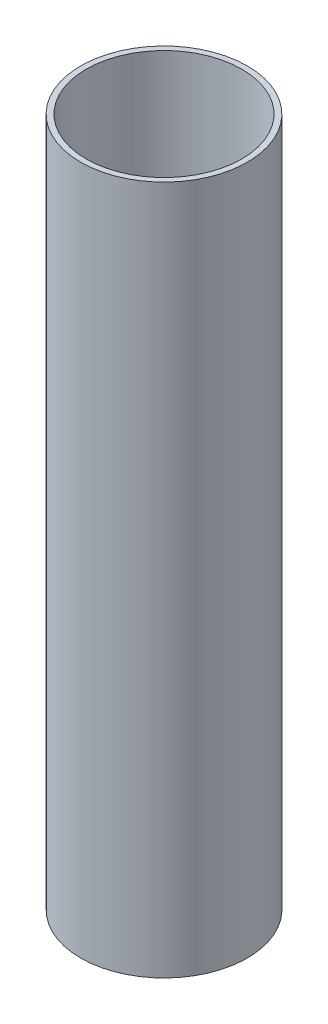
ISO-10303-21;
HEADER;
FILE_DESCRIPTION(('STEP AP214'),'2;1');
FILE_NAME('part.step','',(''),(''),'','','');
FILE_SCHEMA(('AUTOMOTIVE_DESIGN { 1 0 10303 214 1 1 1 1 }'));
ENDSEC;
DATA;
#1=APPLICATION_CONTEXT('core data for automotive mechanical design processes');
#2=APPLICATION_PROTOCOL_DEFINITION('international standard','automotive_design',2000,#1);
#3=PRODUCT_CONTEXT('',#1,'mechanical');
#4=PRODUCT('Part','Part','',(#3));
#5=PRODUCT_RELATED_PRODUCT_CATEGORY('part','',(#4));
#6=PRODUCT_DEFINITION_FORMATION('','',#4);
#7=PRODUCT_DEFINITION_CONTEXT('part definition',#1,'design');
#8=PRODUCT_DEFINITION('design','',#6,#7);
#9=PRODUCT_DEFINITION_SHAPE('','',#8);
#10=(LENGTH_UNIT() NAMED_UNIT(*) SI_UNIT(.MILLI.,.METRE.));
#11=(NAMED_UNIT(*) PLANE_ANGLE_UNIT() SI_UNIT($,.RADIAN.));
#12=(NAMED_UNIT(*) SI_UNIT($,.STERADIAN.) SOLID_ANGLE_UNIT());
#13=UNCERTAINTY_MEASURE_WITH_UNIT(LENGTH_MEASURE(1.E-05),#10,'distance_accuracy_value','');
#14=(GEOMETRIC_REPRESENTATION_CONTEXT(3) GLOBAL_UNCERTAINTY_ASSIGNED_CONTEXT((#13)) GLOBAL_UNIT_ASSIGNED_CONTEXT((#10,
#11,#12)) REPRESENTATION_CONTEXT('',''));
#15=CARTESIAN_POINT('',(0.,0.,0.));
#16=DIRECTION('',(0.,0.,1.));
#17=DIRECTION('',(1.,0.,0.));
#18=AXIS2_PLACEMENT_3D('',#15,#16,#17);
#19=CARTESIAN_POINT('',(0.,310.,0.));
#20=DIRECTION('',(0.,1.,0.));
#21=DIRECTION('',(0.,0.,1.));
#22=AXIS2_PLACEMENT_3D('',#19,#20,#21);
#23=PLANE('',#22);
#24=CARTESIAN_POINT('',(0.,310.,0.));
#25=DIRECTION('',(0.,1.,0.));
#26=DIRECTION('',(0.,0.,1.));
#27=AXIS2_PLACEMENT_3D('',#24,#25,#26);
#28=CIRCLE('',#27,37.5);
#29=CARTESIAN_POINT('',(0.,310.,37.5));
#30=VERTEX_POINT('',#29);
#31=EDGE_CURVE('E10',#30,#30,#28,.T.);
#32=ORIENTED_EDGE('',*,*,#31,.T.);
#33=EDGE_LOOP('',(#32));
#34=FACE_BOUND('',#33,.T.);
#35=CARTESIAN_POINT('',(0.,310.,0.));
#36=DIRECTION('',(0.,1.,0.));
#37=DIRECTION('',(0.,0.,1.));
#38=AXIS2_PLACEMENT_3D('',#35,#36,#37);
#39=CIRCLE('',#38,35.);
#40=CARTESIAN_POINT('',(0.,310.,35.));
#41=VERTEX_POINT('',#40);
#42=EDGE_CURVE('E49',#41,#41,#39,.T.);
#43=ORIENTED_EDGE('',*,*,#42,.F.);
#44=EDGE_LOOP('',(#43));
#45=FACE_BOUND('',#44,.T.);
#46=ADVANCED_FACE('F38',(#34,#45),#23,.T.);
#47=CARTESIAN_POINT('',(0.,0.,0.));
#48=DIRECTION('',(0.,1.,0.));
#49=DIRECTION('',(0.,0.,1.));
#50=AXIS2_PLACEMENT_3D('',#47,#48,#49);
#51=PLANE('',#50);
#52=CARTESIAN_POINT('',(0.,0.,0.));
#53=DIRECTION('',(0.,1.,0.));
#54=DIRECTION('',(0.,0.,1.));
#55=AXIS2_PLACEMENT_3D('',#52,#53,#54);
#56=CIRCLE('',#55,37.5);
#57=CARTESIAN_POINT('',(0.,0.,37.5));
#58=VERTEX_POINT('',#57);
#59=EDGE_CURVE('E42',#58,#58,#56,.T.);
#60=ORIENTED_EDGE('',*,*,#59,.F.);
#61=EDGE_LOOP('',(#60));
#62=FACE_BOUND('',#61,.T.);
#63=CARTESIAN_POINT('',(0.,0.,0.));
#64=DIRECTION('',(0.,1.,0.));
#65=DIRECTION('',(0.,0.,1.));
#66=AXIS2_PLACEMENT_3D('',#63,#64,#65);
#67=CIRCLE('',#66,35.);
#68=CARTESIAN_POINT('',(0.,0.,35.));
#69=VERTEX_POINT('',#68);
#70=EDGE_CURVE('E51',#69,#69,#67,.T.);
#71=ORIENTED_EDGE('',*,*,#70,.T.);
#72=EDGE_LOOP('',(#71));
#73=FACE_BOUND('',#72,.T.);
#74=ADVANCED_FACE('F61',(#62,#73),#51,.F.);
#75=CARTESIAN_POINT('',(0.,310.,0.));
#76=DIRECTION('',(0.,-1.,0.));
#77=DIRECTION('',(0.,0.,-1.));
#78=AXIS2_PLACEMENT_3D('',#75,#76,#77);
#79=CYLINDRICAL_SURFACE('',#78,37.5);
#80=ORIENTED_EDGE('',*,*,#31,.F.);
#81=EDGE_LOOP('',(#80));
#82=FACE_BOUND('',#81,.T.);
#83=ORIENTED_EDGE('',*,*,#59,.T.);
#84=EDGE_LOOP('',(#83));
#85=FACE_BOUND('',#84,.T.);
#86=ADVANCED_FACE('F40',(#82,#85),#79,.T.);
#87=CARTESIAN_POINT('',(0.,310.,0.));
#88=DIRECTION('',(0.,-1.,0.));
#89=DIRECTION('',(0.,0.,-1.));
#90=AXIS2_PLACEMENT_3D('',#87,#88,#89);
#91=CYLINDRICAL_SURFACE('',#90,35.);
#92=ORIENTED_EDGE('',*,*,#42,.T.);
#93=EDGE_LOOP('',(#92));
#94=FACE_BOUND('',#93,.T.);
#95=ORIENTED_EDGE('',*,*,#70,.F.);
#96=EDGE_LOOP('',(#95));
#97=FACE_BOUND('',#96,.T.);
#98=ADVANCED_FACE('F57',(#94,#97),#91,.F.);
#99=CLOSED_SHELL('',(#46,#74,#86,#98));
#100=MANIFOLD_SOLID_BREP('B2',#99);
#101=ADVANCED_BREP_SHAPE_REPRESENTATION('',(#18,#100),#14);
#102=SHAPE_DEFINITION_REPRESENTATION(#9,#101);
ENDSEC;
END-ISO-10303-21;
